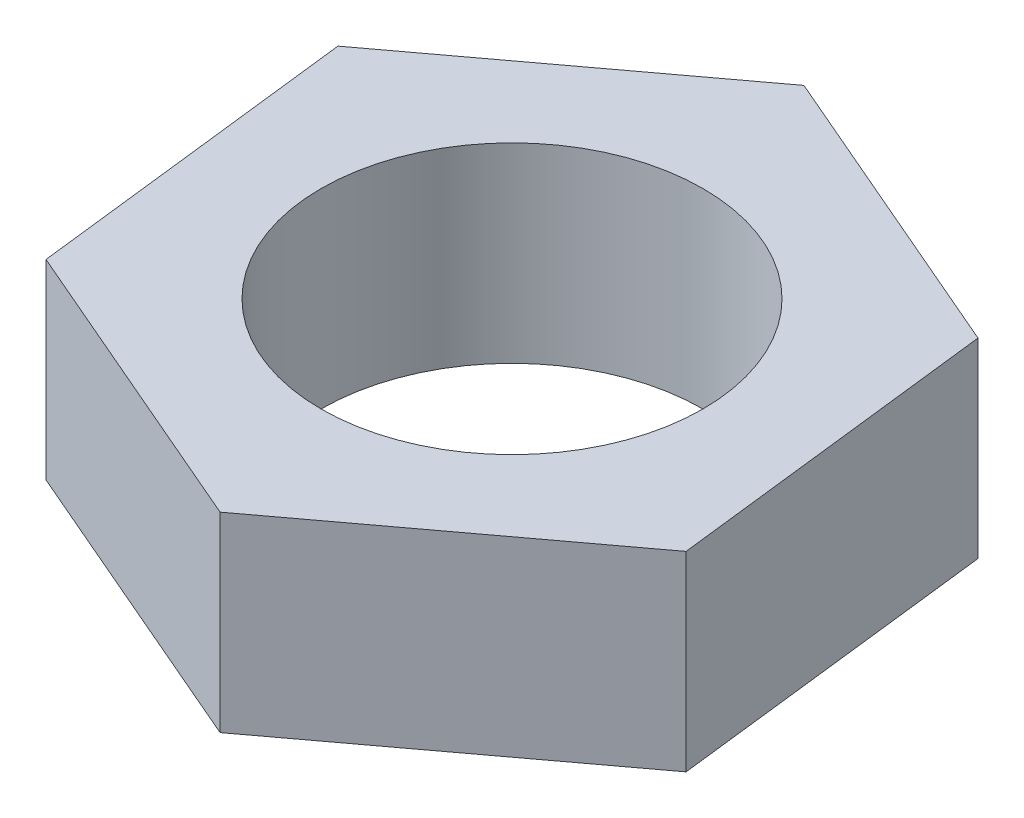
ISO-10303-21;
HEADER;
FILE_DESCRIPTION(('STEP AP214'),'2;1');
FILE_NAME('part.step','',(''),(''),'','','');
FILE_SCHEMA(('AUTOMOTIVE_DESIGN { 1 0 10303 214 1 1 1 1 }'));
ENDSEC;
DATA;
#1=APPLICATION_CONTEXT('core data for automotive mechanical design processes');
#2=APPLICATION_PROTOCOL_DEFINITION('international standard','automotive_design',2000,#1);
#3=PRODUCT_CONTEXT('',#1,'mechanical');
#4=PRODUCT('Part','Part','',(#3));
#5=PRODUCT_RELATED_PRODUCT_CATEGORY('part','',(#4));
#6=PRODUCT_DEFINITION_FORMATION('','',#4);
#7=PRODUCT_DEFINITION_CONTEXT('part definition',#1,'design');
#8=PRODUCT_DEFINITION('design','',#6,#7);
#9=PRODUCT_DEFINITION_SHAPE('','',#8);
#10=(LENGTH_UNIT() NAMED_UNIT(*) SI_UNIT(.MILLI.,.METRE.));
#11=(NAMED_UNIT(*) PLANE_ANGLE_UNIT() SI_UNIT($,.RADIAN.));
#12=(NAMED_UNIT(*) SI_UNIT($,.STERADIAN.) SOLID_ANGLE_UNIT());
#13=UNCERTAINTY_MEASURE_WITH_UNIT(LENGTH_MEASURE(1.E-05),#10,'distance_accuracy_value','');
#14=(GEOMETRIC_REPRESENTATION_CONTEXT(3) GLOBAL_UNCERTAINTY_ASSIGNED_CONTEXT((#13)) GLOBAL_UNIT_ASSIGNED_CONTEXT((#10,
#11,#12)) REPRESENTATION_CONTEXT('',''));
#15=CARTESIAN_POINT('',(0.,0.,0.));
#16=DIRECTION('',(0.,0.,1.));
#17=DIRECTION('',(1.,0.,0.));
#18=AXIS2_PLACEMENT_3D('',#15,#16,#17);
#19=CARTESIAN_POINT('',(-2.03247675077859,10.,-17.3205080756888));
#20=DIRECTION('',(0.597523988325226,0.,0.801851035651831));
#21=DIRECTION('',(0.801851035651831,0.,-0.597523988325226));
#22=AXIS2_PLACEMENT_3D('',#19,#20,#21);
#23=PLANE('',#22);
#24=DIRECTION('',(-0.801851035651831,0.,0.597523988325226));
#25=VECTOR('',#24,1.);
#26=CARTESIAN_POINT('',(-2.03247675077859,0.,-17.3205080756888));
#27=LINE('',#26,#25);
#28=CARTESIAN_POINT('',(-2.03247675077859,0.,-17.3205080756888));
#29=VERTEX_POINT('',#28);
#30=CARTESIAN_POINT('',(-16.0162383753893,0.,-6.90007753906887));
#31=VERTEX_POINT('',#30);
#32=EDGE_CURVE('E118',#29,#31,#27,.T.);
#33=ORIENTED_EDGE('',*,*,#32,.T.);
#34=DIRECTION('',(0.,-1.,0.));
#35=VECTOR('',#34,1.);
#36=CARTESIAN_POINT('',(-16.0162383753893,10.,-6.90007753906887));
#37=LINE('',#36,#35);
#38=CARTESIAN_POINT('',(-16.0162383753893,10.,-6.90007753906887));
#39=VERTEX_POINT('',#38);
#40=EDGE_CURVE('E11',#39,#31,#37,.T.);
#41=ORIENTED_EDGE('',*,*,#40,.F.);
#42=DIRECTION('',(-0.801851035651831,0.,0.597523988325226));
#43=VECTOR('',#42,1.);
#44=CARTESIAN_POINT('',(-2.03247675077859,10.,-17.3205080756888));
#45=LINE('',#44,#43);
#46=CARTESIAN_POINT('',(-2.03247675077859,10.,-17.3205080756888));
#47=VERTEX_POINT('',#46);
#48=EDGE_CURVE('E129',#47,#39,#45,.T.);
#49=ORIENTED_EDGE('',*,*,#48,.F.);
#50=DIRECTION('',(0.,-1.,0.));
#51=VECTOR('',#50,1.);
#52=CARTESIAN_POINT('',(-2.03247675077859,10.,-17.3205080756888));
#53=LINE('',#52,#51);
#54=EDGE_CURVE('E114',#47,#29,#53,.T.);
#55=ORIENTED_EDGE('',*,*,#54,.T.);
#56=EDGE_LOOP('',(#33,#41,#49,#55));
#57=FACE_BOUND('',#56,.T.);
#58=ADVANCED_FACE('F34',(#57),#23,.F.);
#59=CARTESIAN_POINT('',(-16.0162383753893,10.,-6.90007753906887));
#60=DIRECTION('',(0.993185361087961,0.,-0.116545435434327));
#61=DIRECTION('',(-0.116545435434327,0.,-0.993185361087961));
#62=AXIS2_PLACEMENT_3D('',#59,#60,#61);
#63=PLANE('',#62);
#64=DIRECTION('',(0.116545435434327,0.,0.993185361087961));
#65=VECTOR('',#64,1.);
#66=CARTESIAN_POINT('',(-16.0162383753893,0.,-6.90007753906887));
#67=LINE('',#66,#65);
#68=CARTESIAN_POINT('',(-13.9837616246107,0.,10.4204305366199));
#69=VERTEX_POINT('',#68);
#70=EDGE_CURVE('E121',#31,#69,#67,.T.);
#71=ORIENTED_EDGE('',*,*,#70,.T.);
#72=DIRECTION('',(0.,-1.,0.));
#73=VECTOR('',#72,1.);
#74=CARTESIAN_POINT('',(-13.9837616246107,10.,10.4204305366199));
#75=LINE('',#74,#73);
#76=CARTESIAN_POINT('',(-13.9837616246107,10.,10.4204305366199));
#77=VERTEX_POINT('',#76);
#78=EDGE_CURVE('E42',#77,#69,#75,.T.);
#79=ORIENTED_EDGE('',*,*,#78,.F.);
#80=DIRECTION('',(0.116545435434327,0.,0.993185361087961));
#81=VECTOR('',#80,1.);
#82=CARTESIAN_POINT('',(-16.0162383753893,10.,-6.90007753906887));
#83=LINE('',#82,#81);
#84=EDGE_CURVE('E87',#39,#77,#83,.T.);
#85=ORIENTED_EDGE('',*,*,#84,.F.);
#86=ORIENTED_EDGE('',*,*,#40,.T.);
#87=EDGE_LOOP('',(#71,#79,#85,#86));
#88=FACE_BOUND('',#87,.T.);
#89=ADVANCED_FACE('F154',(#88),#63,.F.);
#90=CARTESIAN_POINT('',(-13.9837616246107,10.,10.4204305366199));
#91=DIRECTION('',(0.395661372762734,0.,-0.918396471086158));
#92=DIRECTION('',(-0.918396471086158,0.,-0.395661372762734));
#93=AXIS2_PLACEMENT_3D('',#90,#91,#92);
#94=PLANE('',#93);
#95=DIRECTION('',(0.918396471086158,0.,0.395661372762734));
#96=VECTOR('',#95,1.);
#97=CARTESIAN_POINT('',(-13.9837616246107,0.,10.4204305366199));
#98=LINE('',#97,#96);
#99=CARTESIAN_POINT('',(2.03247675077859,0.,17.3205080756888));
#100=VERTEX_POINT('',#99);
#101=EDGE_CURVE('E124',#69,#100,#98,.T.);
#102=ORIENTED_EDGE('',*,*,#101,.T.);
#103=DIRECTION('',(0.,-1.,0.));
#104=VECTOR('',#103,1.);
#105=CARTESIAN_POINT('',(2.03247675077859,10.,17.3205080756888));
#106=LINE('',#105,#104);
#107=CARTESIAN_POINT('',(2.03247675077859,10.,17.3205080756888));
#108=VERTEX_POINT('',#107);
#109=EDGE_CURVE('E109',#108,#100,#106,.T.);
#110=ORIENTED_EDGE('',*,*,#109,.F.);
#111=DIRECTION('',(0.918396471086158,0.,0.395661372762734));
#112=VECTOR('',#111,1.);
#113=CARTESIAN_POINT('',(-13.9837616246107,10.,10.4204305366199));
#114=LINE('',#113,#112);
#115=EDGE_CURVE('E100',#77,#108,#114,.T.);
#116=ORIENTED_EDGE('',*,*,#115,.F.);
#117=ORIENTED_EDGE('',*,*,#78,.T.);
#118=EDGE_LOOP('',(#102,#110,#116,#117));
#119=FACE_BOUND('',#118,.T.);
#120=ADVANCED_FACE('F135',(#119),#94,.F.);
#121=CARTESIAN_POINT('',(2.03247675077859,10.,17.3205080756888));
#122=DIRECTION('',(-0.597523988325227,0.,-0.801851035651831));
#123=DIRECTION('',(-0.801851035651831,0.,0.597523988325227));
#124=AXIS2_PLACEMENT_3D('',#121,#122,#123);
#125=PLANE('',#124);
#126=DIRECTION('',(0.801851035651831,0.,-0.597523988325227));
#127=VECTOR('',#126,1.);
#128=CARTESIAN_POINT('',(2.03247675077859,0.,17.3205080756888));
#129=LINE('',#128,#127);
#130=CARTESIAN_POINT('',(16.0162383753893,0.,6.90007753906886));
#131=VERTEX_POINT('',#130);
#132=EDGE_CURVE('E108',#100,#131,#129,.T.);
#133=ORIENTED_EDGE('',*,*,#132,.T.);
#134=DIRECTION('',(0.,-1.,0.));
#135=VECTOR('',#134,1.);
#136=CARTESIAN_POINT('',(16.0162383753893,10.,6.90007753906886));
#137=LINE('',#136,#135);
#138=CARTESIAN_POINT('',(16.0162383753893,10.,6.90007753906886));
#139=VERTEX_POINT('',#138);
#140=EDGE_CURVE('E105',#139,#131,#137,.T.);
#141=ORIENTED_EDGE('',*,*,#140,.F.);
#142=DIRECTION('',(0.801851035651831,0.,-0.597523988325227));
#143=VECTOR('',#142,1.);
#144=CARTESIAN_POINT('',(2.03247675077859,10.,17.3205080756888));
#145=LINE('',#144,#143);
#146=EDGE_CURVE('E94',#108,#139,#145,.T.);
#147=ORIENTED_EDGE('',*,*,#146,.F.);
#148=ORIENTED_EDGE('',*,*,#109,.T.);
#149=EDGE_LOOP('',(#133,#141,#147,#148));
#150=FACE_BOUND('',#149,.T.);
#151=ADVANCED_FACE('F106',(#150),#125,.F.);
#152=CARTESIAN_POINT('',(16.0162383753893,10.,6.90007753906886));
#153=DIRECTION('',(-0.993185361087961,0.,0.116545435434327));
#154=DIRECTION('',(0.116545435434327,0.,0.993185361087961));
#155=AXIS2_PLACEMENT_3D('',#152,#153,#154);
#156=PLANE('',#155);
#157=DIRECTION('',(-0.116545435434327,0.,-0.993185361087961));
#158=VECTOR('',#157,1.);
#159=CARTESIAN_POINT('',(16.0162383753893,0.,6.90007753906886));
#160=LINE('',#159,#158);
#161=CARTESIAN_POINT('',(13.9837616246107,0.,-10.4204305366199));
#162=VERTEX_POINT('',#161);
#163=EDGE_CURVE('E73',#131,#162,#160,.T.);
#164=ORIENTED_EDGE('',*,*,#163,.T.);
#165=DIRECTION('',(0.,-1.,0.));
#166=VECTOR('',#165,1.);
#167=CARTESIAN_POINT('',(13.9837616246107,10.,-10.4204305366199));
#168=LINE('',#167,#166);
#169=CARTESIAN_POINT('',(13.9837616246107,10.,-10.4204305366199));
#170=VERTEX_POINT('',#169);
#171=EDGE_CURVE('E110',#170,#162,#168,.T.);
#172=ORIENTED_EDGE('',*,*,#171,.F.);
#173=DIRECTION('',(-0.116545435434327,0.,-0.993185361087961));
#174=VECTOR('',#173,1.);
#175=CARTESIAN_POINT('',(16.0162383753893,10.,6.90007753906886));
#176=LINE('',#175,#174);
#177=EDGE_CURVE('E98',#139,#170,#176,.T.);
#178=ORIENTED_EDGE('',*,*,#177,.F.);
#179=ORIENTED_EDGE('',*,*,#140,.T.);
#180=EDGE_LOOP('',(#164,#172,#178,#179));
#181=FACE_BOUND('',#180,.T.);
#182=ADVANCED_FACE('F112',(#181),#156,.F.);
#183=CARTESIAN_POINT('',(13.9837616246107,10.,-10.4204305366199));
#184=DIRECTION('',(-0.395661372762734,0.,0.918396471086158));
#185=DIRECTION('',(0.918396471086158,0.,0.395661372762734));
#186=AXIS2_PLACEMENT_3D('',#183,#184,#185);
#187=PLANE('',#186);
#188=DIRECTION('',(-0.918396471086158,0.,-0.395661372762734));
#189=VECTOR('',#188,1.);
#190=CARTESIAN_POINT('',(13.9837616246107,0.,-10.4204305366199));
#191=LINE('',#190,#189);
#192=EDGE_CURVE('E79',#162,#29,#191,.T.);
#193=ORIENTED_EDGE('',*,*,#192,.T.);
#194=ORIENTED_EDGE('',*,*,#54,.F.);
#195=DIRECTION('',(-0.918396471086158,0.,-0.395661372762734));
#196=VECTOR('',#195,1.);
#197=CARTESIAN_POINT('',(13.9837616246107,10.,-10.4204305366199));
#198=LINE('',#197,#196);
#199=EDGE_CURVE('E50',#170,#47,#198,.T.);
#200=ORIENTED_EDGE('',*,*,#199,.F.);
#201=ORIENTED_EDGE('',*,*,#171,.T.);
#202=EDGE_LOOP('',(#193,#194,#200,#201));
#203=FACE_BOUND('',#202,.T.);
#204=ADVANCED_FACE('F142',(#203),#187,.F.);
#205=CARTESIAN_POINT('',(0.,10.,0.));
#206=DIRECTION('',(0.,1.,0.));
#207=DIRECTION('',(0.,0.,1.));
#208=AXIS2_PLACEMENT_3D('',#205,#206,#207);
#209=PLANE('',#208);
#210=CARTESIAN_POINT('',(0.,10.,0.));
#211=DIRECTION('',(0.,1.,0.));
#212=DIRECTION('',(0.,0.,1.));
#213=AXIS2_PLACEMENT_3D('',#210,#211,#212);
#214=CIRCLE('',#213,10.);
#215=CARTESIAN_POINT('',(0.,10.,10.));
#216=VERTEX_POINT('',#215);
#217=EDGE_CURVE('E211',#216,#216,#214,.T.);
#218=ORIENTED_EDGE('',*,*,#217,.F.);
#219=EDGE_LOOP('',(#218));
#220=FACE_BOUND('',#219,.T.);
#221=ORIENTED_EDGE('',*,*,#48,.T.);
#222=ORIENTED_EDGE('',*,*,#84,.T.);
#223=ORIENTED_EDGE('',*,*,#115,.T.);
#224=ORIENTED_EDGE('',*,*,#146,.T.);
#225=ORIENTED_EDGE('',*,*,#177,.T.);
#226=ORIENTED_EDGE('',*,*,#199,.T.);
#227=EDGE_LOOP('',(#221,#222,#223,#224,#225,#226));
#228=FACE_BOUND('',#227,.T.);
#229=ADVANCED_FACE('F96',(#220,#228),#209,.T.);
#230=CARTESIAN_POINT('',(0.,0.,0.));
#231=DIRECTION('',(0.,1.,0.));
#232=DIRECTION('',(0.,0.,1.));
#233=AXIS2_PLACEMENT_3D('',#230,#231,#232);
#234=PLANE('',#233);
#235=CARTESIAN_POINT('',(0.,0.,0.));
#236=DIRECTION('',(0.,1.,0.));
#237=DIRECTION('',(0.,0.,1.));
#238=AXIS2_PLACEMENT_3D('',#235,#236,#237);
#239=CIRCLE('',#238,10.);
#240=CARTESIAN_POINT('',(0.,0.,10.));
#241=VERTEX_POINT('',#240);
#242=EDGE_CURVE('E122',#241,#241,#239,.T.);
#243=ORIENTED_EDGE('',*,*,#242,.T.);
#244=EDGE_LOOP('',(#243));
#245=FACE_BOUND('',#244,.T.);
#246=ORIENTED_EDGE('',*,*,#32,.F.);
#247=ORIENTED_EDGE('',*,*,#192,.F.);
#248=ORIENTED_EDGE('',*,*,#163,.F.);
#249=ORIENTED_EDGE('',*,*,#132,.F.);
#250=ORIENTED_EDGE('',*,*,#101,.F.);
#251=ORIENTED_EDGE('',*,*,#70,.F.);
#252=EDGE_LOOP('',(#246,#247,#248,#249,#250,#251));
#253=FACE_BOUND('',#252,.T.);
#254=ADVANCED_FACE('F138',(#245,#253),#234,.F.);
#255=CARTESIAN_POINT('',(0.,0.,0.));
#256=DIRECTION('',(0.,1.,0.));
#257=DIRECTION('',(0.,0.,1.));
#258=AXIS2_PLACEMENT_3D('',#255,#256,#257);
#259=CYLINDRICAL_SURFACE('',#258,10.);
#260=ORIENTED_EDGE('',*,*,#242,.F.);
#261=EDGE_LOOP('',(#260));
#262=FACE_BOUND('',#261,.T.);
#263=ORIENTED_EDGE('',*,*,#217,.T.);
#264=EDGE_LOOP('',(#263));
#265=FACE_BOUND('',#264,.T.);
#266=ADVANCED_FACE('F191',(#262,#265),#259,.F.);
#267=CLOSED_SHELL('',(#58,#89,#120,#151,#182,#204,#229,#254,#266));
#268=MANIFOLD_SOLID_BREP('B2',#267);
#269=ADVANCED_BREP_SHAPE_REPRESENTATION('',(#18,#268),#14);
#270=SHAPE_DEFINITION_REPRESENTATION(#9,#269);
ENDSEC;
END-ISO-10303-21;
